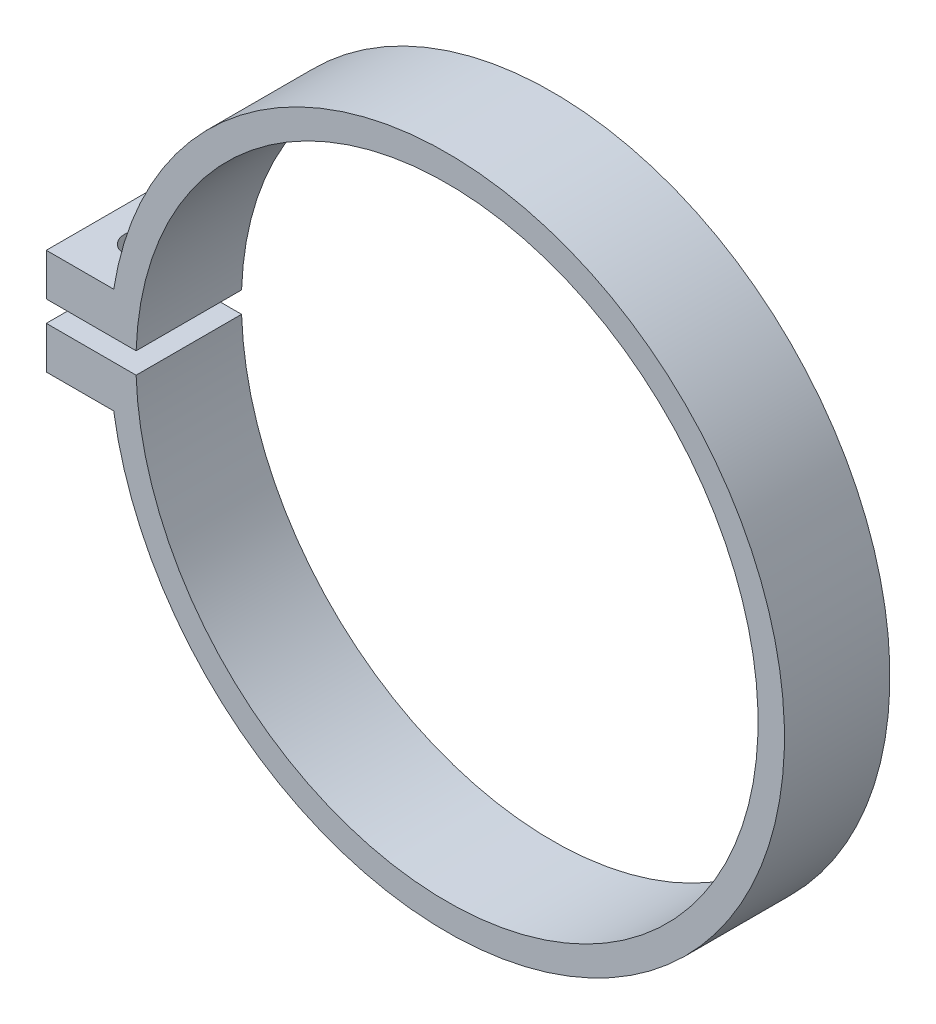
ISO-10303-21;
HEADER;
FILE_DESCRIPTION(('STEP AP214'),'2;1');
FILE_NAME('part.step','',(''),(''),'','','');
FILE_SCHEMA(('AUTOMOTIVE_DESIGN { 1 0 10303 214 1 1 1 1 }'));
ENDSEC;
DATA;
#1=APPLICATION_CONTEXT('core data for automotive mechanical design processes');
#2=APPLICATION_PROTOCOL_DEFINITION('international standard','automotive_design',2000,#1);
#3=PRODUCT_CONTEXT('',#1,'mechanical');
#4=PRODUCT('Part','Part','',(#3));
#5=PRODUCT_RELATED_PRODUCT_CATEGORY('part','',(#4));
#6=PRODUCT_DEFINITION_FORMATION('','',#4);
#7=PRODUCT_DEFINITION_CONTEXT('part definition',#1,'design');
#8=PRODUCT_DEFINITION('design','',#6,#7);
#9=PRODUCT_DEFINITION_SHAPE('','',#8);
#10=(LENGTH_UNIT() NAMED_UNIT(*) SI_UNIT(.MILLI.,.METRE.));
#11=(NAMED_UNIT(*) PLANE_ANGLE_UNIT() SI_UNIT($,.RADIAN.));
#12=(NAMED_UNIT(*) SI_UNIT($,.STERADIAN.) SOLID_ANGLE_UNIT());
#13=UNCERTAINTY_MEASURE_WITH_UNIT(LENGTH_MEASURE(1.E-05),#10,'distance_accuracy_value','');
#14=(GEOMETRIC_REPRESENTATION_CONTEXT(3) GLOBAL_UNCERTAINTY_ASSIGNED_CONTEXT((#13)) GLOBAL_UNIT_ASSIGNED_CONTEXT((#10,
#11,#12)) REPRESENTATION_CONTEXT('',''));
#15=CARTESIAN_POINT('',(0.,0.,0.));
#16=DIRECTION('',(0.,0.,1.));
#17=DIRECTION('',(1.,0.,0.));
#18=AXIS2_PLACEMENT_3D('',#15,#16,#17);
#19=CARTESIAN_POINT('',(0.,0.,5.));
#20=DIRECTION('',(0.,0.,1.));
#21=DIRECTION('',(1.,0.,0.));
#22=AXIS2_PLACEMENT_3D('',#19,#20,#21);
#23=PLANE('',#22);
#24=DIRECTION('',(0.,-1.,0.));
#25=VECTOR('',#24,1.);
#26=CARTESIAN_POINT('',(-38.,5.,5.));
#27=LINE('',#26,#25);
#28=CARTESIAN_POINT('',(-38.,5.,5.));
#29=VERTEX_POINT('',#28);
#30=CARTESIAN_POINT('',(-38.,0.999999999999997,5.));
#31=VERTEX_POINT('',#30);
#32=EDGE_CURVE('E139',#29,#31,#27,.T.);
#33=ORIENTED_EDGE('',*,*,#32,.T.);
#34=DIRECTION('',(1.,0.,0.));
#35=VECTOR('',#34,1.);
#36=CARTESIAN_POINT('',(-38.,0.999999999999997,5.));
#37=LINE('',#36,#35);
#38=CARTESIAN_POINT('',(-29.4830459756111,0.999999999999997,5.));
#39=VERTEX_POINT('',#38);
#40=EDGE_CURVE('E123',#31,#39,#37,.T.);
#41=ORIENTED_EDGE('',*,*,#40,.T.);
#42=CARTESIAN_POINT('',(0.,0.,5.));
#43=DIRECTION('',(0.,0.,1.));
#44=DIRECTION('',(1.,0.,0.));
#45=AXIS2_PLACEMENT_3D('',#42,#43,#44);
#46=CIRCLE('',#45,29.5);
#47=CARTESIAN_POINT('',(-29.4830459756111,-1.,5.));
#48=VERTEX_POINT('',#47);
#49=EDGE_CURVE('E131',#48,#39,#46,.T.);
#50=ORIENTED_EDGE('',*,*,#49,.F.);
#51=DIRECTION('',(1.,0.,0.));
#52=VECTOR('',#51,1.);
#53=CARTESIAN_POINT('',(-38.,-1.,5.));
#54=LINE('',#53,#52);
#55=CARTESIAN_POINT('',(-38.,-1.,5.));
#56=VERTEX_POINT('',#55);
#57=EDGE_CURVE('E140',#56,#48,#54,.T.);
#58=ORIENTED_EDGE('',*,*,#57,.F.);
#59=CARTESIAN_POINT('',(-38.,-5.,5.));
#60=VERTEX_POINT('',#59);
#61=EDGE_CURVE('E151',#56,#60,#27,.T.);
#62=ORIENTED_EDGE('',*,*,#61,.T.);
#63=DIRECTION('',(1.,0.,0.));
#64=VECTOR('',#63,1.);
#65=CARTESIAN_POINT('',(-38.,-5.,5.));
#66=LINE('',#65,#64);
#67=CARTESIAN_POINT('',(-31.6069612585582,-5.,5.));
#68=VERTEX_POINT('',#67);
#69=EDGE_CURVE('E154',#60,#68,#66,.T.);
#70=ORIENTED_EDGE('',*,*,#69,.T.);
#71=CARTESIAN_POINT('',(0.,0.,5.));
#72=DIRECTION('',(0.,0.,1.));
#73=DIRECTION('',(1.,0.,0.));
#74=AXIS2_PLACEMENT_3D('',#71,#72,#73);
#75=CIRCLE('',#74,32.);
#76=CARTESIAN_POINT('',(-31.6069612585582,5.,5.));
#77=VERTEX_POINT('',#76);
#78=EDGE_CURVE('E76',#68,#77,#75,.T.);
#79=ORIENTED_EDGE('',*,*,#78,.T.);
#80=DIRECTION('',(-1.,0.,0.));
#81=VECTOR('',#80,1.);
#82=CARTESIAN_POINT('',(-38.,5.,5.));
#83=LINE('',#82,#81);
#84=EDGE_CURVE('E149',#77,#29,#83,.T.);
#85=ORIENTED_EDGE('',*,*,#84,.T.);
#86=EDGE_LOOP('',(#33,#41,#50,#58,#62,#70,#79,#85));
#87=FACE_BOUND('',#86,.T.);
#88=ADVANCED_FACE('F52',(#87),#23,.T.);
#89=CARTESIAN_POINT('',(0.,0.,-5.));
#90=DIRECTION('',(0.,0.,1.));
#91=DIRECTION('',(1.,0.,0.));
#92=AXIS2_PLACEMENT_3D('',#89,#90,#91);
#93=PLANE('',#92);
#94=DIRECTION('',(1.,0.,0.));
#95=VECTOR('',#94,1.);
#96=CARTESIAN_POINT('',(0.,1.,-5.));
#97=LINE('',#96,#95);
#98=CARTESIAN_POINT('',(-38.,0.999999999999997,-5.));
#99=VERTEX_POINT('',#98);
#100=CARTESIAN_POINT('',(-29.4830459756111,0.999999999999997,-5.));
#101=VERTEX_POINT('',#100);
#102=EDGE_CURVE('E126',#99,#101,#97,.T.);
#103=ORIENTED_EDGE('',*,*,#102,.F.);
#104=DIRECTION('',(0.,-1.,0.));
#105=VECTOR('',#104,1.);
#106=CARTESIAN_POINT('',(-38.,5.,-5.));
#107=LINE('',#106,#105);
#108=CARTESIAN_POINT('',(-38.,5.,-5.));
#109=VERTEX_POINT('',#108);
#110=EDGE_CURVE('E160',#109,#99,#107,.T.);
#111=ORIENTED_EDGE('',*,*,#110,.F.);
#112=DIRECTION('',(-1.,0.,0.));
#113=VECTOR('',#112,1.);
#114=CARTESIAN_POINT('',(-38.,5.,-5.));
#115=LINE('',#114,#113);
#116=CARTESIAN_POINT('',(-31.6069612585582,5.,-5.));
#117=VERTEX_POINT('',#116);
#118=EDGE_CURVE('E148',#117,#109,#115,.T.);
#119=ORIENTED_EDGE('',*,*,#118,.F.);
#120=CARTESIAN_POINT('',(0.,0.,-5.));
#121=DIRECTION('',(0.,0.,1.));
#122=DIRECTION('',(1.,0.,0.));
#123=AXIS2_PLACEMENT_3D('',#120,#121,#122);
#124=CIRCLE('',#123,32.);
#125=CARTESIAN_POINT('',(-31.6069612585582,-5.,-5.));
#126=VERTEX_POINT('',#125);
#127=EDGE_CURVE('E175',#126,#117,#124,.T.);
#128=ORIENTED_EDGE('',*,*,#127,.F.);
#129=DIRECTION('',(1.,0.,0.));
#130=VECTOR('',#129,1.);
#131=CARTESIAN_POINT('',(-38.,-5.,-5.));
#132=LINE('',#131,#130);
#133=CARTESIAN_POINT('',(-38.,-5.,-5.));
#134=VERTEX_POINT('',#133);
#135=EDGE_CURVE('E152',#134,#126,#132,.T.);
#136=ORIENTED_EDGE('',*,*,#135,.F.);
#137=CARTESIAN_POINT('',(-38.,-1.,-5.));
#138=VERTEX_POINT('',#137);
#139=EDGE_CURVE('E159',#138,#134,#107,.T.);
#140=ORIENTED_EDGE('',*,*,#139,.F.);
#141=DIRECTION('',(1.,0.,0.));
#142=VECTOR('',#141,1.);
#143=CARTESIAN_POINT('',(0.,-1.,-5.));
#144=LINE('',#143,#142);
#145=CARTESIAN_POINT('',(-29.4830459756111,-1.,-5.));
#146=VERTEX_POINT('',#145);
#147=EDGE_CURVE('E68',#138,#146,#144,.T.);
#148=ORIENTED_EDGE('',*,*,#147,.T.);
#149=CARTESIAN_POINT('',(0.,0.,-5.));
#150=DIRECTION('',(0.,0.,1.));
#151=DIRECTION('',(1.,0.,0.));
#152=AXIS2_PLACEMENT_3D('',#149,#150,#151);
#153=CIRCLE('',#152,29.5);
#154=EDGE_CURVE('E12',#146,#101,#153,.T.);
#155=ORIENTED_EDGE('',*,*,#154,.T.);
#156=EDGE_LOOP('',(#103,#111,#119,#128,#136,#140,#148,#155));
#157=FACE_BOUND('',#156,.T.);
#158=ADVANCED_FACE('F183',(#157),#93,.F.);
#159=CARTESIAN_POINT('',(-38.,5.,5.));
#160=DIRECTION('',(1.,0.,0.));
#161=DIRECTION('',(0.,0.,-1.));
#162=AXIS2_PLACEMENT_3D('',#159,#160,#161);
#163=PLANE('',#162);
#164=DIRECTION('',(0.,0.,-1.));
#165=VECTOR('',#164,1.);
#166=CARTESIAN_POINT('',(-38.,0.999999999999997,5.));
#167=LINE('',#166,#165);
#168=EDGE_CURVE('E61',#31,#99,#167,.T.);
#169=ORIENTED_EDGE('',*,*,#168,.F.);
#170=ORIENTED_EDGE('',*,*,#32,.F.);
#171=DIRECTION('',(0.,0.,-1.));
#172=VECTOR('',#171,1.);
#173=CARTESIAN_POINT('',(-38.,5.,5.));
#174=LINE('',#173,#172);
#175=EDGE_CURVE('E167',#29,#109,#174,.T.);
#176=ORIENTED_EDGE('',*,*,#175,.T.);
#177=ORIENTED_EDGE('',*,*,#110,.T.);
#178=EDGE_LOOP('',(#169,#170,#176,#177));
#179=FACE_BOUND('',#178,.T.);
#180=ADVANCED_FACE('F185',(#179),#163,.F.);
#181=CARTESIAN_POINT('',(0.,0.,5.));
#182=DIRECTION('',(0.,0.,-1.));
#183=DIRECTION('',(-1.,0.,0.));
#184=AXIS2_PLACEMENT_3D('',#181,#182,#183);
#185=CYLINDRICAL_SURFACE('',#184,32.);
#186=DIRECTION('',(0.,0.,-1.));
#187=VECTOR('',#186,1.);
#188=CARTESIAN_POINT('',(-31.6069612585582,5.,5.));
#189=LINE('',#188,#187);
#190=EDGE_CURVE('E172',#77,#117,#189,.T.);
#191=ORIENTED_EDGE('',*,*,#190,.F.);
#192=ORIENTED_EDGE('',*,*,#78,.F.);
#193=DIRECTION('',(0.,0.,-1.));
#194=VECTOR('',#193,1.);
#195=CARTESIAN_POINT('',(-31.6069612585582,-5.,5.));
#196=LINE('',#195,#194);
#197=EDGE_CURVE('E170',#126,#68,#196,.F.);
#198=ORIENTED_EDGE('',*,*,#197,.F.);
#199=ORIENTED_EDGE('',*,*,#127,.T.);
#200=EDGE_LOOP('',(#191,#192,#198,#199));
#201=FACE_BOUND('',#200,.T.);
#202=ADVANCED_FACE('F54',(#201),#185,.T.);
#203=CARTESIAN_POINT('',(-38.,5.,5.));
#204=DIRECTION('',(0.,-1.,0.));
#205=DIRECTION('',(0.,0.,-1.));
#206=AXIS2_PLACEMENT_3D('',#203,#204,#205);
#207=PLANE('',#206);
#208=CARTESIAN_POINT('',(-34.,5.,0.));
#209=DIRECTION('',(0.,-1.,0.));
#210=DIRECTION('',(0.,0.,-1.));
#211=AXIS2_PLACEMENT_3D('',#208,#209,#210);
#212=CIRCLE('',#211,1.60000000000001);
#213=CARTESIAN_POINT('',(-34.,5.,-1.60000000000001));
#214=VERTEX_POINT('',#213);
#215=EDGE_CURVE('E142',#214,#214,#212,.T.);
#216=ORIENTED_EDGE('',*,*,#215,.T.);
#217=EDGE_LOOP('',(#216));
#218=FACE_BOUND('',#217,.T.);
#219=ORIENTED_EDGE('',*,*,#84,.F.);
#220=ORIENTED_EDGE('',*,*,#190,.T.);
#221=ORIENTED_EDGE('',*,*,#118,.T.);
#222=ORIENTED_EDGE('',*,*,#175,.F.);
#223=EDGE_LOOP('',(#219,#220,#221,#222));
#224=FACE_BOUND('',#223,.T.);
#225=ADVANCED_FACE('F189',(#218,#224),#207,.F.);
#226=CARTESIAN_POINT('',(-38.,-5.,5.));
#227=DIRECTION('',(0.,1.,0.));
#228=DIRECTION('',(-1.,0.,0.));
#229=AXIS2_PLACEMENT_3D('',#226,#227,#228);
#230=PLANE('',#229);
#231=CARTESIAN_POINT('',(-34.,-5.,0.));
#232=DIRECTION('',(0.,1.,0.));
#233=DIRECTION('',(-1.,0.,0.));
#234=AXIS2_PLACEMENT_3D('',#231,#232,#233);
#235=CIRCLE('',#234,1.60000000000001);
#236=CARTESIAN_POINT('',(-35.6,-5.,0.));
#237=VERTEX_POINT('',#236);
#238=EDGE_CURVE('E231',#237,#237,#235,.F.);
#239=ORIENTED_EDGE('',*,*,#238,.F.);
#240=EDGE_LOOP('',(#239));
#241=FACE_BOUND('',#240,.T.);
#242=ORIENTED_EDGE('',*,*,#135,.T.);
#243=ORIENTED_EDGE('',*,*,#197,.T.);
#244=ORIENTED_EDGE('',*,*,#69,.F.);
#245=DIRECTION('',(0.,0.,-1.));
#246=VECTOR('',#245,1.);
#247=CARTESIAN_POINT('',(-38.,-5.,5.));
#248=LINE('',#247,#246);
#249=EDGE_CURVE('E157',#60,#134,#248,.T.);
#250=ORIENTED_EDGE('',*,*,#249,.T.);
#251=EDGE_LOOP('',(#242,#243,#244,#250));
#252=FACE_BOUND('',#251,.T.);
#253=ADVANCED_FACE('F194',(#241,#252),#230,.F.);
#254=ORIENTED_EDGE('',*,*,#61,.F.);
#255=DIRECTION('',(0.,0.,-1.));
#256=VECTOR('',#255,1.);
#257=CARTESIAN_POINT('',(-38.,-1.,5.));
#258=LINE('',#257,#256);
#259=EDGE_CURVE('E177',#56,#138,#258,.T.);
#260=ORIENTED_EDGE('',*,*,#259,.T.);
#261=ORIENTED_EDGE('',*,*,#139,.T.);
#262=ORIENTED_EDGE('',*,*,#249,.F.);
#263=EDGE_LOOP('',(#254,#260,#261,#262));
#264=FACE_BOUND('',#263,.T.);
#265=ADVANCED_FACE('F198',(#264),#163,.F.);
#266=CARTESIAN_POINT('',(0.,0.,-21.5));
#267=DIRECTION('',(0.,0.,1.));
#268=DIRECTION('',(1.,0.,0.));
#269=AXIS2_PLACEMENT_3D('',#266,#267,#268);
#270=CYLINDRICAL_SURFACE('',#269,29.5);
#271=DIRECTION('',(0.,0.,1.));
#272=VECTOR('',#271,1.);
#273=CARTESIAN_POINT('',(-29.4830459756111,-1.,-21.5));
#274=LINE('',#273,#272);
#275=EDGE_CURVE('E128',#146,#48,#274,.T.);
#276=ORIENTED_EDGE('',*,*,#275,.T.);
#277=ORIENTED_EDGE('',*,*,#49,.T.);
#278=DIRECTION('',(0.,0.,1.));
#279=VECTOR('',#278,1.);
#280=CARTESIAN_POINT('',(-29.4830459756111,0.999999999999997,-21.5));
#281=LINE('',#280,#279);
#282=EDGE_CURVE('E119',#101,#39,#281,.T.);
#283=ORIENTED_EDGE('',*,*,#282,.F.);
#284=ORIENTED_EDGE('',*,*,#154,.F.);
#285=EDGE_LOOP('',(#276,#277,#283,#284));
#286=FACE_BOUND('',#285,.T.);
#287=ADVANCED_FACE('F132',(#286),#270,.F.);
#288=CARTESIAN_POINT('',(-38.,0.999999999999997,-21.5));
#289=DIRECTION('',(0.,-1.,0.));
#290=DIRECTION('',(1.,0.,0.));
#291=AXIS2_PLACEMENT_3D('',#288,#289,#290);
#292=PLANE('',#291);
#293=CARTESIAN_POINT('',(-34.,0.999999999999997,0.));
#294=DIRECTION('',(0.,-1.,0.));
#295=DIRECTION('',(1.,0.,0.));
#296=AXIS2_PLACEMENT_3D('',#293,#294,#295);
#297=CIRCLE('',#296,1.60000000000001);
#298=CARTESIAN_POINT('',(-32.4,0.999999999999998,0.));
#299=VERTEX_POINT('',#298);
#300=EDGE_CURVE('E233',#299,#299,#297,.T.);
#301=ORIENTED_EDGE('',*,*,#300,.F.);
#302=EDGE_LOOP('',(#301));
#303=FACE_BOUND('',#302,.T.);
#304=ORIENTED_EDGE('',*,*,#102,.T.);
#305=ORIENTED_EDGE('',*,*,#282,.T.);
#306=ORIENTED_EDGE('',*,*,#40,.F.);
#307=ORIENTED_EDGE('',*,*,#168,.T.);
#308=EDGE_LOOP('',(#304,#305,#306,#307));
#309=FACE_BOUND('',#308,.T.);
#310=ADVANCED_FACE('F121',(#303,#309),#292,.T.);
#311=CARTESIAN_POINT('',(-38.,-1.,-21.5));
#312=DIRECTION('',(0.,-1.,0.));
#313=DIRECTION('',(1.,0.,0.));
#314=AXIS2_PLACEMENT_3D('',#311,#312,#313);
#315=PLANE('',#314);
#316=CARTESIAN_POINT('',(-34.,-1.,0.));
#317=DIRECTION('',(0.,-1.,0.));
#318=DIRECTION('',(1.,0.,0.));
#319=AXIS2_PLACEMENT_3D('',#316,#317,#318);
#320=CIRCLE('',#319,1.60000000000001);
#321=CARTESIAN_POINT('',(-32.4,-1.,0.));
#322=VERTEX_POINT('',#321);
#323=EDGE_CURVE('E56',#322,#322,#320,.T.);
#324=ORIENTED_EDGE('',*,*,#323,.T.);
#325=EDGE_LOOP('',(#324));
#326=FACE_BOUND('',#325,.T.);
#327=ORIENTED_EDGE('',*,*,#259,.F.);
#328=ORIENTED_EDGE('',*,*,#57,.T.);
#329=ORIENTED_EDGE('',*,*,#275,.F.);
#330=ORIENTED_EDGE('',*,*,#147,.F.);
#331=EDGE_LOOP('',(#327,#328,#329,#330));
#332=FACE_BOUND('',#331,.T.);
#333=ADVANCED_FACE('F199',(#326,#332),#315,.F.);
#334=CARTESIAN_POINT('',(-34.,-9.52548339959392,0.));
#335=DIRECTION('',(0.,1.,0.));
#336=DIRECTION('',(-1.,0.,0.));
#337=AXIS2_PLACEMENT_3D('',#334,#335,#336);
#338=CYLINDRICAL_SURFACE('',#337,1.60000000000001);
#339=ORIENTED_EDGE('',*,*,#238,.T.);
#340=EDGE_LOOP('',(#339));
#341=FACE_BOUND('',#340,.T.);
#342=ORIENTED_EDGE('',*,*,#323,.F.);
#343=EDGE_LOOP('',(#342));
#344=FACE_BOUND('',#343,.T.);
#345=ADVANCED_FACE('F201',(#341,#344),#338,.F.);
#346=ORIENTED_EDGE('',*,*,#300,.T.);
#347=EDGE_LOOP('',(#346));
#348=FACE_BOUND('',#347,.T.);
#349=ORIENTED_EDGE('',*,*,#215,.F.);
#350=EDGE_LOOP('',(#349));
#351=FACE_BOUND('',#350,.T.);
#352=ADVANCED_FACE('F208',(#348,#351),#338,.F.);
#353=CLOSED_SHELL('',(#88,#158,#180,#202,#225,#253,#265,#287,#310,#333,#345,#352));
#354=MANIFOLD_SOLID_BREP('B2',#353);
#355=ADVANCED_BREP_SHAPE_REPRESENTATION('',(#18,#354),#14);
#356=SHAPE_DEFINITION_REPRESENTATION(#9,#355);
ENDSEC;
END-ISO-10303-21;
